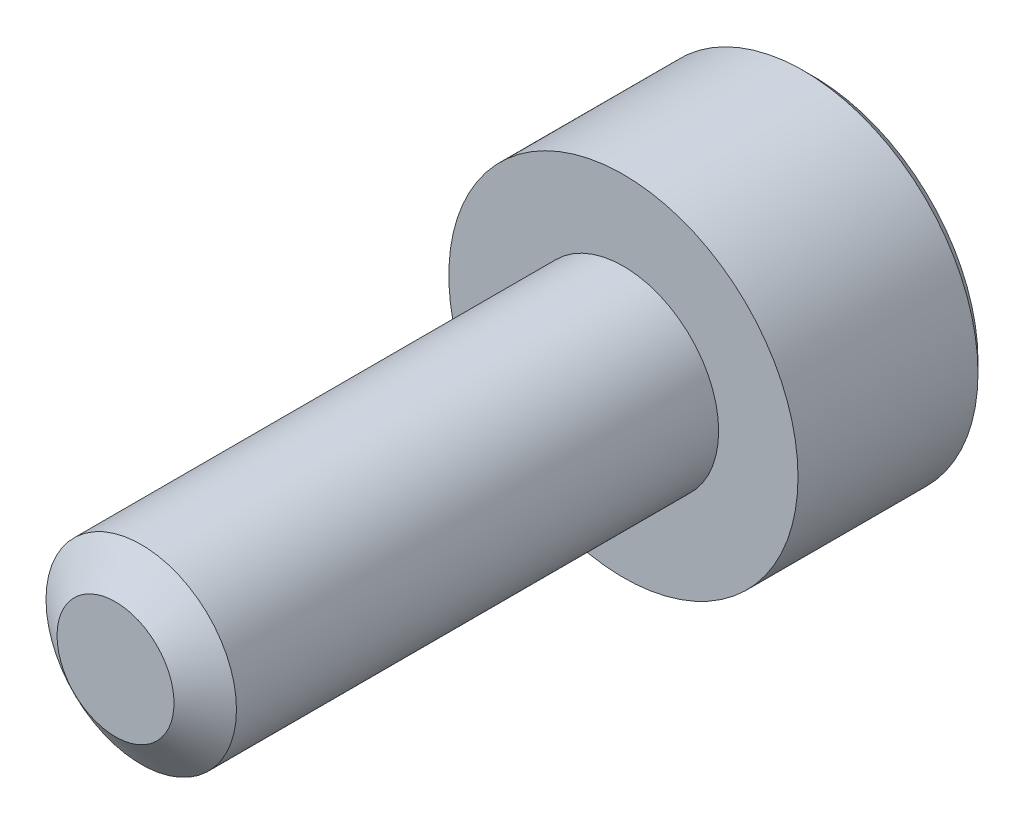
ISO-10303-21;
HEADER;
FILE_DESCRIPTION(('STEP AP214'),'2;1');
FILE_NAME('part.step','',(''),(''),'','','');
FILE_SCHEMA(('AUTOMOTIVE_DESIGN { 1 0 10303 214 1 1 1 1 }'));
ENDSEC;
DATA;
#1=APPLICATION_CONTEXT('core data for automotive mechanical design processes');
#2=APPLICATION_PROTOCOL_DEFINITION('international standard','automotive_design',2000,#1);
#3=PRODUCT_CONTEXT('',#1,'mechanical');
#4=PRODUCT('Part','Part','',(#3));
#5=PRODUCT_RELATED_PRODUCT_CATEGORY('part','',(#4));
#6=PRODUCT_DEFINITION_FORMATION('','',#4);
#7=PRODUCT_DEFINITION_CONTEXT('part definition',#1,'design');
#8=PRODUCT_DEFINITION('design','',#6,#7);
#9=PRODUCT_DEFINITION_SHAPE('','',#8);
#10=(LENGTH_UNIT() NAMED_UNIT(*) SI_UNIT(.MILLI.,.METRE.));
#11=(NAMED_UNIT(*) PLANE_ANGLE_UNIT() SI_UNIT($,.RADIAN.));
#12=(NAMED_UNIT(*) SI_UNIT($,.STERADIAN.) SOLID_ANGLE_UNIT());
#13=UNCERTAINTY_MEASURE_WITH_UNIT(LENGTH_MEASURE(1.E-05),#10,'distance_accuracy_value','');
#14=(GEOMETRIC_REPRESENTATION_CONTEXT(3) GLOBAL_UNCERTAINTY_ASSIGNED_CONTEXT((#13)) GLOBAL_UNIT_ASSIGNED_CONTEXT((#10,
#11,#12)) REPRESENTATION_CONTEXT('',''));
#15=CARTESIAN_POINT('',(0.,0.,0.));
#16=DIRECTION('',(0.,0.,1.));
#17=DIRECTION('',(1.,0.,0.));
#18=AXIS2_PLACEMENT_3D('',#15,#16,#17);
#19=CARTESIAN_POINT('',(0.,-1.44337567297406,-9.125));
#20=DIRECTION('',(-0.5,-0.866025403784439,0.));
#21=DIRECTION('',(0.866025403784439,-0.5,0.));
#22=AXIS2_PLACEMENT_3D('',#19,#20,#21);
#23=PLANE('',#22);
#24=CARTESIAN_POINT('',(-1.24999999999923,-0.721687836487472,-11.0000000000205));
#25=CARTESIAN_POINT('',(-1.20703689149526,-0.746492598747462,-10.9752190397385));
#26=CARTESIAN_POINT('',(-1.16335543595367,-0.771712098862997,-10.9518937494833));
#27=CARTESIAN_POINT('',(-1.07428446543606,-0.823137247668316,-10.9091861389306));
#28=CARTESIAN_POINT('',(-1.02888648443478,-0.849347784220073,-10.8898275733697));
#29=CARTESIAN_POINT('',(-0.937343688522001,-0.902200042082686,-10.8566662159237));
#30=CARTESIAN_POINT('',(-0.891222174141652,-0.928828310825614,-10.8427800967941));
#31=CARTESIAN_POINT('',(-0.797964038891582,-0.982670920316364,-10.8213859018106));
#32=CARTESIAN_POINT('',(-0.750830264933908,-1.00988361739875,-10.8138618619324));
#33=CARTESIAN_POINT('',(-0.669590913522095,-1.05678717880515,-10.807072827807));
#34=CARTESIAN_POINT('',(-0.635590177984652,-1.07641751262034,-10.8060681886655));
#35=CARTESIAN_POINT('',(-0.567648554675665,-1.11564362712696,-10.8077634952321));
#36=CARTESIAN_POINT('',(-0.533707681782417,-1.13523939922841,-10.8104642592724));
#37=CARTESIAN_POINT('',(-0.466153619735912,-1.17424175513581,-10.8194142483557));
#38=CARTESIAN_POINT('',(-0.432540764897579,-1.19364814592496,-10.825666773068));
#39=CARTESIAN_POINT('',(-0.36587626075785,-1.23213691533542,-10.8413835392564));
#40=CARTESIAN_POINT('',(-0.332824858668661,-1.25121915122871,-10.8508491588693));
#41=CARTESIAN_POINT('',(-0.248213569935116,-1.3000695015555,-10.8789283315911));
#42=CARTESIAN_POINT('',(-0.197186124430318,-1.32953021095376,-10.899649345075));
#43=CARTESIAN_POINT('',(-0.097127605618787,-1.38729902372431,-10.9463235058317));
#44=CARTESIAN_POINT('',(-0.0480906425343108,-1.41561052756137,-10.9722596212441));
#45=CARTESIAN_POINT('',(3.61131954926437E-12,-1.44337567297615,-11.000000000023));
#46=B_SPLINE_CURVE_WITH_KNOTS('',3,(#24,#25,#26,#27,#28,#29,#30,#31,#32,#33,#34,#35,#36,#37,#38,
#39,#40,#41,#42,#43,#44,#45),.UNSPECIFIED.,.F.,.F.,(4,2,2,2,2,2,2,2,2,2,4),(0.,
0.166478683225655,0.333926926832445,0.498716658517836,0.66309165462773,0.780745575559699,
0.898425484352725,1.0162148997715,1.13405490052567,1.32111591641725,1.50757565758986),.UNSPECIFIED.);
#47=CARTESIAN_POINT('',(-1.25000000005161,-0.721687836457233,-11.0000000000507));
#48=VERTEX_POINT('',#47);
#49=CARTESIAN_POINT('',(-5.01839715878229E-11,-1.44337567300512,-11.000000000052));
#50=VERTEX_POINT('',#49);
#51=EDGE_CURVE('E21',#48,#50,#46,.T.);
#52=ORIENTED_EDGE('',*,*,#51,.F.);
#53=DIRECTION('',(0.,0.,1.));
#54=VECTOR('',#53,1.);
#55=CARTESIAN_POINT('',(-1.25,-0.721687836487032,-9.125));
#56=LINE('',#55,#54);
#57=CARTESIAN_POINT('',(-1.25,-0.721687836487031,-9.125));
#58=VERTEX_POINT('',#57);
#59=EDGE_CURVE('E104',#48,#58,#56,.T.);
#60=ORIENTED_EDGE('',*,*,#59,.T.);
#61=DIRECTION('',(0.866025403784439,-0.5,0.));
#62=VECTOR('',#61,1.);
#63=CARTESIAN_POINT('',(0.,-1.44337567297406,-9.125));
#64=LINE('',#63,#62);
#65=CARTESIAN_POINT('',(0.,-1.44337567297406,-9.125));
#66=VERTEX_POINT('',#65);
#67=EDGE_CURVE('E77',#66,#58,#64,.F.);
#68=ORIENTED_EDGE('',*,*,#67,.F.);
#69=DIRECTION('',(0.,0.,1.));
#70=VECTOR('',#69,1.);
#71=CARTESIAN_POINT('',(0.,-1.44337567297406,-9.125));
#72=LINE('',#71,#70);
#73=EDGE_CURVE('E76',#66,#50,#72,.F.);
#74=ORIENTED_EDGE('',*,*,#73,.T.);
#75=EDGE_LOOP('',(#52,#60,#68,#74));
#76=FACE_BOUND('',#75,.T.);
#77=ADVANCED_FACE('F17',(#76),#23,.F.);
#78=CARTESIAN_POINT('',(1.25,-0.721687836487033,-9.125));
#79=DIRECTION('',(0.5,-0.866025403784439,0.));
#80=DIRECTION('',(0.866025403784439,0.5,0.));
#81=AXIS2_PLACEMENT_3D('',#78,#79,#80);
#82=PLANE('',#81);
#83=CARTESIAN_POINT('',(-3.6074023830296E-12,-1.44337567297615,-11.000000000023));
#84=CARTESIAN_POINT('',(0.0429631085006193,-1.41857091071601,-10.9752190397408));
#85=CARTESIAN_POINT('',(0.0866445640424776,-1.39335141060032,-10.9518937494853));
#86=CARTESIAN_POINT('',(0.175715534560631,-1.34192626179469,-10.909186138932));
#87=CARTESIAN_POINT('',(0.221113515562204,-1.31571572524276,-10.8898275733709));
#88=CARTESIAN_POINT('',(0.312656311475584,-1.2628634673798,-10.8566662159245));
#89=CARTESIAN_POINT('',(0.358777825856245,-1.23623519863669,-10.8427800967947));
#90=CARTESIAN_POINT('',(0.452035961106958,-1.18239258914557,-10.8213859018109));
#91=CARTESIAN_POINT('',(0.499169735064965,-1.15517989206299,-10.8138618619325));
#92=CARTESIAN_POINT('',(0.580409086477129,-1.10827633065639,-10.8070728278071));
#93=CARTESIAN_POINT('',(0.614409822014588,-1.08864599684119,-10.8060681886655));
#94=CARTESIAN_POINT('',(0.682351445323609,-1.04941988233455,-10.807763495232));
#95=CARTESIAN_POINT('',(0.716292318216875,-1.02982411023309,-10.8104642592723));
#96=CARTESIAN_POINT('',(0.783846380263412,-0.99082175432567,-10.8194142483556));
#97=CARTESIAN_POINT('',(0.81745923510176,-0.971415363536519,-10.8256667730679));
#98=CARTESIAN_POINT('',(0.884123739241519,-0.932926594126036,-10.8413835392562));
#99=CARTESIAN_POINT('',(0.917175141330723,-0.913844358232739,-10.8508491588691));
#100=CARTESIAN_POINT('',(1.0017864300636,-0.86499400790633,-10.8789283315906));
#101=CARTESIAN_POINT('',(1.05281387556774,-0.835533298508456,-10.8996493450742));
#102=CARTESIAN_POINT('',(1.15287239437801,-0.777764485738631,-10.9463235058301));
#103=CARTESIAN_POINT('',(1.20190935746189,-0.749452981901914,-10.9722596212421));
#104=CARTESIAN_POINT('',(1.24999999999923,-0.721687836487477,-11.0000000000205));
#105=B_SPLINE_CURVE_WITH_KNOTS('',3,(#83,#84,#85,#86,#87,#88,#89,#90,#91,#92,#93,#94,#95,#96,
#97,#98,#99,#100,#101,#102,#103,#104),.UNSPECIFIED.,.F.,.F.,(4,2,2,2,2,2,2,2,2,2,4),(0.,
0.166478683226823,0.333926926834808,0.498716658521388,0.66309165463246,0.780745575564486,
0.898425484357568,1.01621489977638,1.1340549005306,1.32111591641969,1.50757565758986),.UNSPECIFIED.);
#106=CARTESIAN_POINT('',(1.25,-0.721687836547066,-11.0000000000509));
#107=VERTEX_POINT('',#106);
#108=EDGE_CURVE('E84',#50,#107,#105,.T.);
#109=ORIENTED_EDGE('',*,*,#108,.F.);
#110=ORIENTED_EDGE('',*,*,#73,.F.);
#111=DIRECTION('',(-0.86602540378444,-0.499999999999997,0.));
#112=VECTOR('',#111,1.);
#113=CARTESIAN_POINT('',(1.25,-0.721687836487033,-9.125));
#114=LINE('',#113,#112);
#115=CARTESIAN_POINT('',(1.25,-0.721687836487033,-9.125));
#116=VERTEX_POINT('',#115);
#117=EDGE_CURVE('E268',#116,#66,#114,.T.);
#118=ORIENTED_EDGE('',*,*,#117,.F.);
#119=DIRECTION('',(0.,0.,-1.));
#120=VECTOR('',#119,1.);
#121=CARTESIAN_POINT('',(1.25,-0.721687836487033,-9.125));
#122=LINE('',#121,#120);
#123=EDGE_CURVE('E103',#116,#107,#122,.T.);
#124=ORIENTED_EDGE('',*,*,#123,.T.);
#125=EDGE_LOOP('',(#109,#110,#118,#124));
#126=FACE_BOUND('',#125,.T.);
#127=ADVANCED_FACE('F101',(#126),#82,.F.);
#128=CARTESIAN_POINT('',(-1.25,-0.721687836487032,-9.125));
#129=DIRECTION('',(-1.,0.,0.));
#130=DIRECTION('',(0.,-1.,0.));
#131=AXIS2_PLACEMENT_3D('',#128,#129,#130);
#132=PLANE('',#131);
#133=CARTESIAN_POINT('',(-1.25,0.721687836486145,-11.0000000000205));
#134=CARTESIAN_POINT('',(-1.25,0.672078311978691,-10.9752190397376));
#135=CARTESIAN_POINT('',(-1.25,0.621639311760224,-10.9518937494808));
#136=CARTESIAN_POINT('',(-1.25,0.51878901417478,-10.9091861389237));
#137=CARTESIAN_POINT('',(-1.25,0.466367941083855,-10.88982757336));
#138=CARTESIAN_POINT('',(-1.25,0.360663425383132,-10.8566662159065));
#139=CARTESIAN_POINT('',(-1.25,0.307406887909187,-10.8427800967724));
#140=CARTESIAN_POINT('',(-1.25,0.199721668950897,-10.8213859017783));
#141=CARTESIAN_POINT('',(-1.25,0.145296274797427,-10.8138618618939));
#142=CARTESIAN_POINT('',(-1.25,0.0514891520108285,-10.8070728277577));
#143=CARTESIAN_POINT('',(-1.25,0.0122284843956205,-10.806068188611));
#144=CARTESIAN_POINT('',(-1.25,-0.0662237445878595,-10.8077634951655));
#145=CARTESIAN_POINT('',(-1.25,-0.105415288776155,-10.810464259199));
#146=CARTESIAN_POINT('',(-1.25,-0.183420000562422,-10.8194142482674));
#147=CARTESIAN_POINT('',(-1.25,-0.222232782126771,-10.8256667729716));
#148=CARTESIAN_POINT('',(-1.25,-0.299210320920453,-10.841383539143));
#149=CARTESIAN_POINT('',(-1.25,-0.337374792693718,-10.8508491587471));
#150=CARTESIAN_POINT('',(-1.25,-0.435075493390417,-10.8789283314678));
#151=CARTESIAN_POINT('',(-1.25,-0.493996912241092,-10.8996493449682));
#152=CARTESIAN_POINT('',(-1.25,-0.609534537885974,-10.9463235057696));
#153=CARTESIAN_POINT('',(-1.25,-0.666157545609713,-10.9722596212102));
#154=CARTESIAN_POINT('',(-1.25,-0.721687836486145,-11.0000000000205));
#155=B_SPLINE_CURVE_WITH_KNOTS('',3,(#133,#134,#135,#136,#137,#138,#139,#140,#141,#142,#143,
#144,#145,#146,#147,#148,#149,#150,#151,#152,#153,#154),.UNSPECIFIED.,.F.,.F.,(4,2,2,2,2,2,2,2,
2,2,4),(0.,0.166478683193298,0.333926926767723,0.498716658422077,0.663091654500959,
0.780745575387943,0.89842548413593,1.0162148995096,1.13405490021865,1.32111591627871,
1.5075756576204),.UNSPECIFIED.);
#156=CARTESIAN_POINT('',(-1.25,0.721687836546622,-11.0000000000507));
#157=VERTEX_POINT('',#156);
#158=EDGE_CURVE('E61',#157,#48,#155,.T.);
#159=ORIENTED_EDGE('',*,*,#158,.F.);
#160=DIRECTION('',(0.,0.,1.));
#161=VECTOR('',#160,1.);
#162=CARTESIAN_POINT('',(-1.25,0.721687836487032,-9.125));
#163=LINE('',#162,#161);
#164=CARTESIAN_POINT('',(-1.25,0.721687836487032,-9.125));
#165=VERTEX_POINT('',#164);
#166=EDGE_CURVE('E245',#157,#165,#163,.T.);
#167=ORIENTED_EDGE('',*,*,#166,.T.);
#168=DIRECTION('',(0.,1.,0.));
#169=VECTOR('',#168,1.);
#170=CARTESIAN_POINT('',(-1.25,2.1650635094611,-9.125));
#171=LINE('',#170,#169);
#172=EDGE_CURVE('E264',#58,#165,#171,.T.);
#173=ORIENTED_EDGE('',*,*,#172,.F.);
#174=ORIENTED_EDGE('',*,*,#59,.F.);
#175=EDGE_LOOP('',(#159,#167,#173,#174));
#176=FACE_BOUND('',#175,.T.);
#177=ADVANCED_FACE('F122',(#176),#132,.F.);
#178=CARTESIAN_POINT('',(1.25,2.1650635094611,-9.125));
#179=DIRECTION('',(0.,0.,-1.));
#180=DIRECTION('',(-1.,0.,0.));
#181=AXIS2_PLACEMENT_3D('',#178,#179,#180);
#182=PLANE('',#181);
#183=ORIENTED_EDGE('',*,*,#67,.T.);
#184=ORIENTED_EDGE('',*,*,#172,.T.);
#185=DIRECTION('',(-0.866025403784439,-0.5,0.));
#186=VECTOR('',#185,1.);
#187=CARTESIAN_POINT('',(-1.25,0.721687836487032,-9.125));
#188=LINE('',#187,#186);
#189=CARTESIAN_POINT('',(0.,1.44337567297406,-9.125));
#190=VERTEX_POINT('',#189);
#191=EDGE_CURVE('E144',#165,#190,#188,.F.);
#192=ORIENTED_EDGE('',*,*,#191,.T.);
#193=DIRECTION('',(-0.866025403784439,0.5,0.));
#194=VECTOR('',#193,1.);
#195=CARTESIAN_POINT('',(0.,1.44337567297406,-9.125));
#196=LINE('',#195,#194);
#197=CARTESIAN_POINT('',(1.25,0.721687836487029,-9.125));
#198=VERTEX_POINT('',#197);
#199=EDGE_CURVE('E242',#190,#198,#196,.F.);
#200=ORIENTED_EDGE('',*,*,#199,.T.);
#201=DIRECTION('',(0.,1.,0.));
#202=VECTOR('',#201,1.);
#203=CARTESIAN_POINT('',(1.25,0.721687836487032,-9.125));
#204=LINE('',#203,#202);
#205=EDGE_CURVE('E259',#198,#116,#204,.F.);
#206=ORIENTED_EDGE('',*,*,#205,.T.);
#207=ORIENTED_EDGE('',*,*,#117,.T.);
#208=EDGE_LOOP('',(#183,#184,#192,#200,#206,#207));
#209=FACE_BOUND('',#208,.T.);
#210=ADVANCED_FACE('F126',(#209),#182,.T.);
#211=CARTESIAN_POINT('',(1.25,0.721687836487032,-9.125));
#212=DIRECTION('',(1.,0.,0.));
#213=DIRECTION('',(0.,0.,-1.));
#214=AXIS2_PLACEMENT_3D('',#211,#212,#213);
#215=PLANE('',#214);
#216=CARTESIAN_POINT('',(1.25,-0.721687836486145,-11.0000000000205));
#217=CARTESIAN_POINT('',(1.25,-0.672078311978688,-10.9752190397376));
#218=CARTESIAN_POINT('',(1.25,-0.621639311760217,-10.9518937494808));
#219=CARTESIAN_POINT('',(1.25,-0.518789014174766,-10.9091861389237));
#220=CARTESIAN_POINT('',(1.25,-0.466367941083838,-10.88982757336));
#221=CARTESIAN_POINT('',(1.25,-0.360663425383114,-10.8566662159065));
#222=CARTESIAN_POINT('',(1.25,-0.307406887909172,-10.8427800967724));
#223=CARTESIAN_POINT('',(1.25,-0.199721668950889,-10.8213859017783));
#224=CARTESIAN_POINT('',(1.25,-0.145296274797422,-10.8138618618939));
#225=CARTESIAN_POINT('',(1.25,-0.0514891520108276,-10.8070728277577));
#226=CARTESIAN_POINT('',(1.25,-0.0122284843956208,-10.806068188611));
#227=CARTESIAN_POINT('',(1.25,0.0662237445878569,-10.8077634951655));
#228=CARTESIAN_POINT('',(1.25,0.105415288776151,-10.810464259199));
#229=CARTESIAN_POINT('',(1.25,0.183420000562418,-10.8194142482673));
#230=CARTESIAN_POINT('',(1.25,0.222232782126768,-10.8256667729716));
#231=CARTESIAN_POINT('',(1.25,0.299210320920453,-10.841383539143));
#232=CARTESIAN_POINT('',(1.25,0.337374792693719,-10.8508491587471));
#233=CARTESIAN_POINT('',(1.25,0.435075493391091,-10.878928331468));
#234=CARTESIAN_POINT('',(1.25,0.493996912242415,-10.8996493449686));
#235=CARTESIAN_POINT('',(1.25,0.609534537888543,-10.9463235057707));
#236=CARTESIAN_POINT('',(1.25,0.66615754561288,-10.9722596212117));
#237=CARTESIAN_POINT('',(1.25,0.721687836489885,-11.0000000000223));
#238=B_SPLINE_CURVE_WITH_KNOTS('',3,(#216,#217,#218,#219,#220,#221,#222,#223,#224,#225,#226,
#227,#228,#229,#230,#231,#232,#233,#234,#235,#236,#237),.UNSPECIFIED.,.F.,.F.,(4,2,2,2,2,2,2,2,
2,2,4),(0.,0.166478683193309,0.333926926767745,0.498716658422089,0.663091654500961,
0.780745575387941,0.898425484135925,1.0162148995096,1.13405490021866,1.32111591628081,
1.50757565762458),.UNSPECIFIED.);
#239=CARTESIAN_POINT('',(1.25000000002599,0.721687836502039,-11.0000000000509));
#240=VERTEX_POINT('',#239);
#241=EDGE_CURVE('E40',#107,#240,#238,.T.);
#242=ORIENTED_EDGE('',*,*,#241,.F.);
#243=ORIENTED_EDGE('',*,*,#123,.F.);
#244=ORIENTED_EDGE('',*,*,#205,.F.);
#245=DIRECTION('',(0.,0.,1.));
#246=VECTOR('',#245,1.);
#247=CARTESIAN_POINT('',(1.25,0.721687836487029,-9.125));
#248=LINE('',#247,#246);
#249=EDGE_CURVE('E238',#198,#240,#248,.F.);
#250=ORIENTED_EDGE('',*,*,#249,.T.);
#251=EDGE_LOOP('',(#242,#243,#244,#250));
#252=FACE_BOUND('',#251,.T.);
#253=ADVANCED_FACE('F130',(#252),#215,.F.);
#254=CARTESIAN_POINT('',(-1.25,0.721687836487032,-9.125));
#255=DIRECTION('',(-0.5,0.866025403784439,0.));
#256=DIRECTION('',(-0.866025403784439,-0.5,0.));
#257=AXIS2_PLACEMENT_3D('',#254,#255,#256);
#258=PLANE('',#257);
#259=CARTESIAN_POINT('',(6.84630244901692E-12,1.44337567297802,-11.0000000000249));
#260=CARTESIAN_POINT('',(-0.0429631084975728,1.41857091071777,-10.9752190397424));
#261=CARTESIAN_POINT('',(-0.0866445640396289,1.39335141060197,-10.9518937494867));
#262=CARTESIAN_POINT('',(-0.175715534558197,1.34192626179609,-10.9091861389331));
#263=CARTESIAN_POINT('',(-0.221113515559987,1.31571572524404,-10.8898275733718));
#264=CARTESIAN_POINT('',(-0.312656311473812,1.26286346738082,-10.856666215925));
#265=CARTESIAN_POINT('',(-0.358777825854701,1.23623519863758,-10.8427800967951));
#266=CARTESIAN_POINT('',(-0.452035961105885,1.18239258914619,-10.821385901811));
#267=CARTESIAN_POINT('',(-0.499169735064134,1.15517989206347,-10.8138618619326));
#268=CARTESIAN_POINT('',(-0.580409086476554,1.10827633065672,-10.8070728278071));
#269=CARTESIAN_POINT('',(-0.614409822014024,1.08864599684152,-10.8060681886655));
#270=CARTESIAN_POINT('',(-0.682351445323067,1.04941988233486,-10.807763495232));
#271=CARTESIAN_POINT('',(-0.716292318216345,1.0298241102334,-10.8104642592723));
#272=CARTESIAN_POINT('',(-0.783846380262906,0.990821754325961,-10.8194142483555));
#273=CARTESIAN_POINT('',(-0.817459235101266,0.971415363536803,-10.8256667730678));
#274=CARTESIAN_POINT('',(-0.884123739241049,0.932926594126306,-10.8413835392561));
#275=CARTESIAN_POINT('',(-0.917175141330265,0.913844358233003,-10.8508491588689));
#276=CARTESIAN_POINT('',(-1.00178643006323,0.864994007906542,-10.8789283315905));
#277=CARTESIAN_POINT('',(-1.05281387556745,0.835533298508624,-10.899649345074));
#278=CARTESIAN_POINT('',(-1.15287239437787,0.777764485738712,-10.94632350583));
#279=CARTESIAN_POINT('',(-1.20190935746182,0.749452981901953,-10.972259621242));
#280=CARTESIAN_POINT('',(-1.24999999999923,0.721687836487475,-11.0000000000205));
#281=B_SPLINE_CURVE_WITH_KNOTS('',3,(#259,#260,#261,#262,#263,#264,#265,#266,#267,#268,#269,
#270,#271,#272,#273,#274,#275,#276,#277,#278,#279,#280),.UNSPECIFIED.,.F.,.F.,(4,2,2,2,2,2,2,2,
2,2,4),(0.,0.166478683227699,0.333926926836579,0.498716658524029,0.663091654635963,
0.780745575568026,0.898425484361146,1.01621489977999,1.13405490053424,1.3211159164236,
1.50757565759404),.UNSPECIFIED.);
#282=CARTESIAN_POINT('',(-4.8570560907805E-11,1.44337567300606,-11.0000000000529));
#283=VERTEX_POINT('',#282);
#284=EDGE_CURVE('E145',#283,#157,#281,.T.);
#285=ORIENTED_EDGE('',*,*,#284,.F.);
#286=DIRECTION('',(0.,0.,1.));
#287=VECTOR('',#286,1.);
#288=CARTESIAN_POINT('',(0.,1.44337567297406,-9.125));
#289=LINE('',#288,#287);
#290=EDGE_CURVE('E170',#283,#190,#289,.T.);
#291=ORIENTED_EDGE('',*,*,#290,.T.);
#292=ORIENTED_EDGE('',*,*,#191,.F.);
#293=ORIENTED_EDGE('',*,*,#166,.F.);
#294=EDGE_LOOP('',(#285,#291,#292,#293));
#295=FACE_BOUND('',#294,.T.);
#296=ADVANCED_FACE('F135',(#295),#258,.F.);
#297=CARTESIAN_POINT('',(0.,1.44337567297406,-9.125));
#298=DIRECTION('',(0.5,0.866025403784439,0.));
#299=DIRECTION('',(-0.866025403784439,0.5,0.));
#300=AXIS2_PLACEMENT_3D('',#297,#298,#299);
#301=PLANE('',#300);
#302=CARTESIAN_POINT('',(-6.8491199462737E-12,1.44337567297801,-11.0000000000249));
#303=CARTESIAN_POINT('',(0.042963108497573,1.41857091071776,-10.9752190397424));
#304=CARTESIAN_POINT('',(0.0866445640396318,1.39335141060196,-10.9518937494867));
#305=CARTESIAN_POINT('',(0.175715534558206,1.34192626179608,-10.9091861389331));
#306=CARTESIAN_POINT('',(0.221113515559999,1.31571572524403,-10.8898275733718));
#307=CARTESIAN_POINT('',(0.312656311473824,1.26286346738081,-10.856666215925));
#308=CARTESIAN_POINT('',(0.35877782585471,1.23623519863757,-10.8427800967951));
#309=CARTESIAN_POINT('',(0.452035961105888,1.18239258914618,-10.821385901811));
#310=CARTESIAN_POINT('',(0.499169735064134,1.15517989206347,-10.8138618619326));
#311=CARTESIAN_POINT('',(0.58040908647655,1.10827633065672,-10.8070728278071));
#312=CARTESIAN_POINT('',(0.614409822014018,1.08864599684152,-10.8060681886655));
#313=CARTESIAN_POINT('',(0.682351445323059,1.04941988233486,-10.807763495232));
#314=CARTESIAN_POINT('',(0.716292318216336,1.0298241102334,-10.8104642592723));
#315=CARTESIAN_POINT('',(0.783846380262897,0.990821754325963,-10.8194142483555));
#316=CARTESIAN_POINT('',(0.817459235101258,0.971415363536804,-10.8256667730678));
#317=CARTESIAN_POINT('',(0.884123739241042,0.932926594126306,-10.8413835392561));
#318=CARTESIAN_POINT('',(0.91717514133026,0.913844358233002,-10.8508491588689));
#319=CARTESIAN_POINT('',(1.00178643006381,0.864994007906204,-10.8789283315907));
#320=CARTESIAN_POINT('',(1.05281387556859,0.835533298507962,-10.8996493450745));
#321=CARTESIAN_POINT('',(1.15287239438009,0.777764485737426,-10.9463235058311));
#322=CARTESIAN_POINT('',(1.20190935746456,0.749452981900368,-10.9722596212435));
#323=CARTESIAN_POINT('',(1.25000000000247,0.721687836485602,-11.0000000000223));
#324=B_SPLINE_CURVE_WITH_KNOTS('',3,(#302,#303,#304,#305,#306,#307,#308,#309,#310,#311,#312,
#313,#314,#315,#316,#317,#318,#319,#320,#321,#322,#323),.UNSPECIFIED.,.F.,.F.,(4,2,2,2,2,2,2,2,
2,2,4),(0.,0.166478683227709,0.3339269268366,0.49871665852404,0.663091654635962,
0.780745575568021,0.898425484361137,1.01621489977999,1.13405490053424,1.3211159164257,
1.50757565759821),.UNSPECIFIED.);
#325=EDGE_CURVE('E162',#283,#240,#324,.T.);
#326=ORIENTED_EDGE('',*,*,#325,.T.);
#327=ORIENTED_EDGE('',*,*,#249,.F.);
#328=ORIENTED_EDGE('',*,*,#199,.F.);
#329=ORIENTED_EDGE('',*,*,#290,.F.);
#330=EDGE_LOOP('',(#326,#327,#328,#329));
#331=FACE_BOUND('',#330,.T.);
#332=ADVANCED_FACE('F172',(#331),#301,.F.);
#333=CARTESIAN_POINT('',(0.,0.,-10.9999999999673));
#334=DIRECTION('',(0.,0.,-1.));
#335=DIRECTION('',(-1.,0.,0.));
#336=AXIS2_PLACEMENT_3D('',#333,#334,#335);
#337=CONICAL_SURFACE('',#336,1.44337567292041,0.785398163397448);
#338=ORIENTED_EDGE('',*,*,#284,.T.);
#339=CARTESIAN_POINT('',(0.,0.,-11.0000000000809));
#340=DIRECTION('',(0.,0.,-1.));
#341=DIRECTION('',(-1.,0.,0.));
#342=AXIS2_PLACEMENT_3D('',#339,#340,#341);
#343=CIRCLE('',#342,1.4433756730341);
#344=EDGE_CURVE('E169',#283,#157,#343,.F.);
#345=ORIENTED_EDGE('',*,*,#344,.F.);
#346=EDGE_LOOP('',(#338,#345));
#347=FACE_BOUND('',#346,.T.);
#348=ADVANCED_FACE('F175',(#347),#337,.F.);
#349=CARTESIAN_POINT('',(0.,0.,-10.9999999999673));
#350=DIRECTION('',(0.,0.,-1.));
#351=DIRECTION('',(-1.,0.,0.));
#352=AXIS2_PLACEMENT_3D('',#349,#350,#351);
#353=CONICAL_SURFACE('',#352,1.44337567292041,0.785398163251348);
#354=CARTESIAN_POINT('',(0.,0.,-11.0000000000241));
#355=DIRECTION('',(0.,0.,-1.));
#356=DIRECTION('',(-1.,0.,0.));
#357=AXIS2_PLACEMENT_3D('',#354,#355,#356);
#358=CIRCLE('',#357,1.44337567297725);
#359=EDGE_CURVE('E94',#157,#48,#358,.F.);
#360=ORIENTED_EDGE('',*,*,#359,.F.);
#361=ORIENTED_EDGE('',*,*,#158,.T.);
#362=EDGE_LOOP('',(#360,#361));
#363=FACE_BOUND('',#362,.T.);
#364=ADVANCED_FACE('F179',(#363),#353,.F.);
#365=CARTESIAN_POINT('',(0.,0.,-10.9999999999673));
#366=DIRECTION('',(0.,0.,-1.));
#367=DIRECTION('',(-1.,0.,0.));
#368=AXIS2_PLACEMENT_3D('',#365,#366,#367);
#369=CONICAL_SURFACE('',#368,1.44337567292041,0.785398163397448);
#370=ORIENTED_EDGE('',*,*,#51,.T.);
#371=CARTESIAN_POINT('',(0.,0.,-11.0000000000809));
#372=DIRECTION('',(0.,0.,-1.));
#373=DIRECTION('',(-1.,0.,0.));
#374=AXIS2_PLACEMENT_3D('',#371,#372,#373);
#375=CIRCLE('',#374,1.4433756730341);
#376=EDGE_CURVE('E72',#48,#50,#375,.F.);
#377=ORIENTED_EDGE('',*,*,#376,.F.);
#378=EDGE_LOOP('',(#370,#377));
#379=FACE_BOUND('',#378,.T.);
#380=ADVANCED_FACE('F70',(#379),#369,.F.);
#381=CARTESIAN_POINT('',(0.,0.,-10.9999999999673));
#382=DIRECTION('',(0.,0.,-1.));
#383=DIRECTION('',(-1.,0.,0.));
#384=AXIS2_PLACEMENT_3D('',#381,#382,#383);
#385=CONICAL_SURFACE('',#384,1.44337567292041,0.785398163397448);
#386=ORIENTED_EDGE('',*,*,#108,.T.);
#387=CARTESIAN_POINT('',(0.,0.,-11.0000000000809));
#388=DIRECTION('',(0.,0.,-1.));
#389=DIRECTION('',(-1.,0.,0.));
#390=AXIS2_PLACEMENT_3D('',#387,#388,#389);
#391=CIRCLE('',#390,1.4433756730341);
#392=EDGE_CURVE('E92',#50,#107,#391,.F.);
#393=ORIENTED_EDGE('',*,*,#392,.F.);
#394=EDGE_LOOP('',(#386,#393));
#395=FACE_BOUND('',#394,.T.);
#396=ADVANCED_FACE('F97',(#395),#385,.F.);
#397=CARTESIAN_POINT('',(0.,0.,-10.9999999999673));
#398=DIRECTION('',(0.,0.,-1.));
#399=DIRECTION('',(-1.,0.,0.));
#400=AXIS2_PLACEMENT_3D('',#397,#398,#399);
#401=CONICAL_SURFACE('',#400,1.44337567292041,0.785398163251348);
#402=ORIENTED_EDGE('',*,*,#241,.T.);
#403=CARTESIAN_POINT('',(0.,0.,-11.0000000000241));
#404=DIRECTION('',(0.,0.,-1.));
#405=DIRECTION('',(-1.,0.,0.));
#406=AXIS2_PLACEMENT_3D('',#403,#404,#405);
#407=CIRCLE('',#406,1.44337567297725);
#408=EDGE_CURVE('E99',#107,#240,#407,.F.);
#409=ORIENTED_EDGE('',*,*,#408,.F.);
#410=EDGE_LOOP('',(#402,#409));
#411=FACE_BOUND('',#410,.T.);
#412=ADVANCED_FACE('F152',(#411),#401,.F.);
#413=CARTESIAN_POINT('',(0.,0.,-10.9999999999673));
#414=DIRECTION('',(0.,0.,-1.));
#415=DIRECTION('',(-1.,0.,0.));
#416=AXIS2_PLACEMENT_3D('',#413,#414,#415);
#417=CONICAL_SURFACE('',#416,1.44337567292041,0.785398163397448);
#418=ORIENTED_EDGE('',*,*,#325,.F.);
#419=CARTESIAN_POINT('',(0.,0.,-11.0000000000809));
#420=DIRECTION('',(0.,0.,-1.));
#421=DIRECTION('',(-1.,0.,0.));
#422=AXIS2_PLACEMENT_3D('',#419,#420,#421);
#423=CIRCLE('',#422,1.4433756730341);
#424=EDGE_CURVE('E230',#240,#283,#423,.F.);
#425=ORIENTED_EDGE('',*,*,#424,.F.);
#426=EDGE_LOOP('',(#418,#425));
#427=FACE_BOUND('',#426,.T.);
#428=ADVANCED_FACE('F156',(#427),#417,.F.);
#429=CARTESIAN_POINT('',(0.,0.,-11.));
#430=DIRECTION('',(0.,0.,-1.));
#431=DIRECTION('',(-1.,0.,0.));
#432=AXIS2_PLACEMENT_3D('',#429,#430,#431);
#433=PLANE('',#432);
#434=ORIENTED_EDGE('',*,*,#408,.T.);
#435=ORIENTED_EDGE('',*,*,#424,.T.);
#436=ORIENTED_EDGE('',*,*,#344,.T.);
#437=ORIENTED_EDGE('',*,*,#359,.T.);
#438=ORIENTED_EDGE('',*,*,#376,.T.);
#439=ORIENTED_EDGE('',*,*,#392,.T.);
#440=EDGE_LOOP('',(#434,#435,#436,#437,#438,#439));
#441=FACE_BOUND('',#440,.T.);
#442=CARTESIAN_POINT('',(0.,0.,-10.9999999999673));
#443=DIRECTION('',(0.,0.,1.));
#444=DIRECTION('',(1.,0.,0.));
#445=AXIS2_PLACEMENT_3D('',#442,#443,#444);
#446=CIRCLE('',#445,2.58500000012418);
#447=CARTESIAN_POINT('',(2.58500000012418,0.,-10.9999999999673));
#448=VERTEX_POINT('',#447);
#449=EDGE_CURVE('E221',#448,#448,#446,.T.);
#450=ORIENTED_EDGE('',*,*,#449,.F.);
#451=EDGE_LOOP('',(#450));
#452=FACE_BOUND('',#451,.T.);
#453=ADVANCED_FACE('F90',(#441,#452),#433,.T.);
#454=CARTESIAN_POINT('',(0.,0.,-10.8350000000428));
#455=DIRECTION('',(0.,0.,1.));
#456=DIRECTION('',(1.,0.,0.));
#457=AXIS2_PLACEMENT_3D('',#454,#455,#456);
#458=CONICAL_SURFACE('',#457,2.75000000004866,0.785398163397448);
#459=ORIENTED_EDGE('',*,*,#449,.T.);
#460=EDGE_LOOP('',(#459));
#461=FACE_BOUND('',#460,.T.);
#462=CARTESIAN_POINT('',(0.,0.,-10.835));
#463=DIRECTION('',(0.,0.,1.));
#464=DIRECTION('',(1.,0.,0.));
#465=AXIS2_PLACEMENT_3D('',#462,#463,#464);
#466=CIRCLE('',#465,2.75);
#467=CARTESIAN_POINT('',(2.75,0.,-10.835));
#468=VERTEX_POINT('',#467);
#469=EDGE_CURVE('E224',#468,#468,#466,.T.);
#470=ORIENTED_EDGE('',*,*,#469,.F.);
#471=EDGE_LOOP('',(#470));
#472=FACE_BOUND('',#471,.T.);
#473=ADVANCED_FACE('F211',(#461,#472),#458,.T.);
#474=CARTESIAN_POINT('',(0.,0.,0.));
#475=DIRECTION('',(0.,0.,1.));
#476=DIRECTION('',(1.,0.,0.));
#477=AXIS2_PLACEMENT_3D('',#474,#475,#476);
#478=PLANE('',#477);
#479=CARTESIAN_POINT('',(0.,0.,5.6843418860808E-11));
#480=DIRECTION('',(0.,0.,-1.));
#481=DIRECTION('',(-1.,0.,0.));
#482=AXIS2_PLACEMENT_3D('',#479,#480,#481);
#483=CIRCLE('',#482,0.921240473587659);
#484=CARTESIAN_POINT('',(-0.921240473587659,0.,5.6843418860808E-11));
#485=VERTEX_POINT('',#484);
#486=EDGE_CURVE('E225',#485,#485,#483,.T.);
#487=ORIENTED_EDGE('',*,*,#486,.F.);
#488=EDGE_LOOP('',(#487));
#489=FACE_BOUND('',#488,.T.);
#490=ADVANCED_FACE('F208',(#489),#478,.T.);
#491=CARTESIAN_POINT('',(0.,0.,-11.));
#492=DIRECTION('',(0.,0.,1.));
#493=DIRECTION('',(1.,0.,0.));
#494=AXIS2_PLACEMENT_3D('',#491,#492,#493);
#495=CYLINDRICAL_SURFACE('',#494,2.75);
#496=ORIENTED_EDGE('',*,*,#469,.T.);
#497=EDGE_LOOP('',(#496));
#498=FACE_BOUND('',#497,.T.);
#499=CARTESIAN_POINT('',(0.,0.,-8.));
#500=DIRECTION('',(0.,0.,1.));
#501=DIRECTION('',(1.,0.,0.));
#502=AXIS2_PLACEMENT_3D('',#499,#500,#501);
#503=CIRCLE('',#502,2.75);
#504=CARTESIAN_POINT('',(2.75,0.,-8.));
#505=VERTEX_POINT('',#504);
#506=EDGE_CURVE('E228',#505,#505,#503,.F.);
#507=ORIENTED_EDGE('',*,*,#506,.T.);
#508=EDGE_LOOP('',(#507));
#509=FACE_BOUND('',#508,.T.);
#510=ADVANCED_FACE('F204',(#498,#509),#495,.T.);
#511=CARTESIAN_POINT('',(0.,0.,-0.405251783149652));
#512=DIRECTION('',(0.,0.,-1.));
#513=DIRECTION('',(-1.,0.,0.));
#514=AXIS2_PLACEMENT_3D('',#511,#512,#513);
#515=CONICAL_SURFACE('',#514,1.50000000002137,0.959931088612039);
#516=ORIENTED_EDGE('',*,*,#486,.T.);
#517=EDGE_LOOP('',(#516));
#518=FACE_BOUND('',#517,.T.);
#519=CARTESIAN_POINT('',(0.,0.,-0.405251783209379));
#520=DIRECTION('',(0.,0.,1.));
#521=DIRECTION('',(1.,0.,0.));
#522=AXIS2_PLACEMENT_3D('',#519,#520,#521);
#523=CIRCLE('',#522,1.5);
#524=CARTESIAN_POINT('',(1.5,0.,-0.405251783209379));
#525=VERTEX_POINT('',#524);
#526=EDGE_CURVE('E32',#525,#525,#523,.F.);
#527=ORIENTED_EDGE('',*,*,#526,.F.);
#528=EDGE_LOOP('',(#527));
#529=FACE_BOUND('',#528,.T.);
#530=ADVANCED_FACE('F197',(#518,#529),#515,.T.);
#531=CARTESIAN_POINT('',(0.,0.,-8.));
#532=DIRECTION('',(0.,0.,-1.));
#533=DIRECTION('',(-1.,0.,0.));
#534=AXIS2_PLACEMENT_3D('',#531,#532,#533);
#535=PLANE('',#534);
#536=CARTESIAN_POINT('',(0.,0.,-8.));
#537=DIRECTION('',(0.,0.,1.));
#538=DIRECTION('',(1.,0.,0.));
#539=AXIS2_PLACEMENT_3D('',#536,#537,#538);
#540=CIRCLE('',#539,1.5);
#541=CARTESIAN_POINT('',(1.5,0.,-8.));
#542=VERTEX_POINT('',#541);
#543=EDGE_CURVE('E11',#542,#542,#540,.T.);
#544=ORIENTED_EDGE('',*,*,#543,.F.);
#545=EDGE_LOOP('',(#544));
#546=FACE_BOUND('',#545,.T.);
#547=ORIENTED_EDGE('',*,*,#506,.F.);
#548=EDGE_LOOP('',(#547));
#549=FACE_BOUND('',#548,.T.);
#550=ADVANCED_FACE('F191',(#546,#549),#535,.F.);
#551=CARTESIAN_POINT('',(0.,0.,-8.));
#552=DIRECTION('',(0.,0.,1.));
#553=DIRECTION('',(1.,0.,0.));
#554=AXIS2_PLACEMENT_3D('',#551,#552,#553);
#555=CYLINDRICAL_SURFACE('',#554,1.5);
#556=ORIENTED_EDGE('',*,*,#543,.T.);
#557=EDGE_LOOP('',(#556));
#558=FACE_BOUND('',#557,.T.);
#559=ORIENTED_EDGE('',*,*,#526,.T.);
#560=EDGE_LOOP('',(#559));
#561=FACE_BOUND('',#560,.T.);
#562=ADVANCED_FACE('F189',(#558,#561),#555,.T.);
#563=CLOSED_SHELL('',(#77,#127,#177,#210,#253,#296,#332,#348,#364,#380,#396,#412,#428,#453,#473,
#490,#510,#530,#550,#562));
#564=MANIFOLD_SOLID_BREP('B1',#563);
#565=ADVANCED_BREP_SHAPE_REPRESENTATION('',(#18,#564),#14);
#566=SHAPE_DEFINITION_REPRESENTATION(#9,#565);
ENDSEC;
END-ISO-10303-21;
